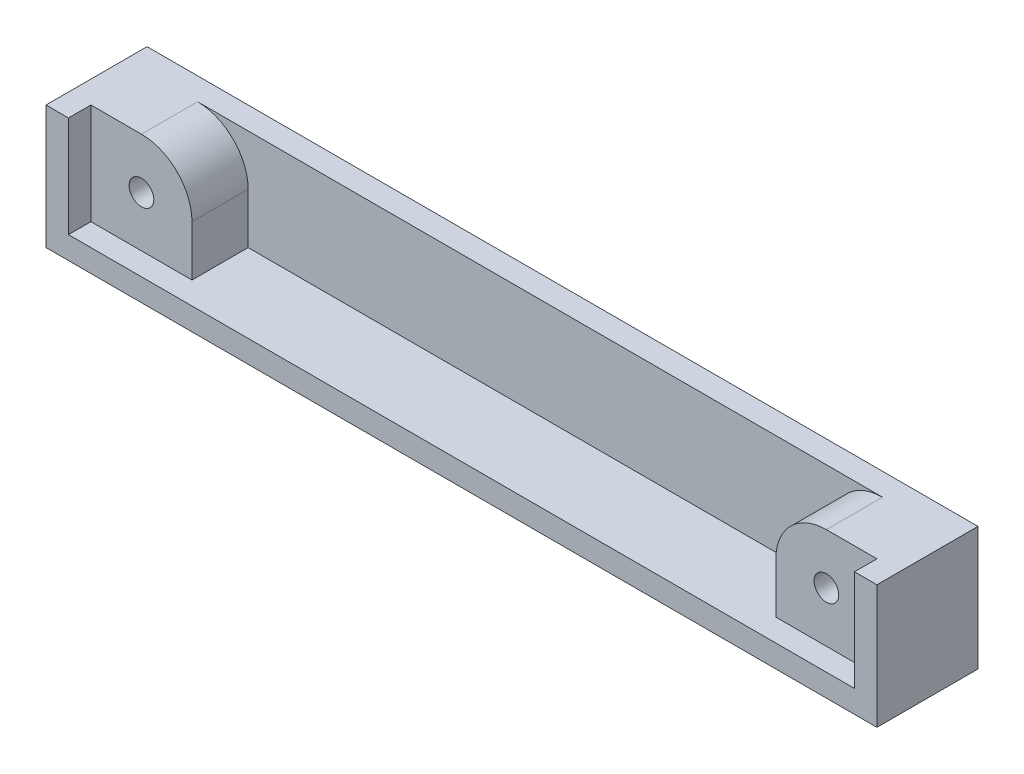
ISO-10303-21;
HEADER;
FILE_DESCRIPTION(('STEP AP214'),'2;1');
FILE_NAME('part.step','',(''),(''),'','','');
FILE_SCHEMA(('AUTOMOTIVE_DESIGN { 1 0 10303 214 1 1 1 1 }'));
ENDSEC;
DATA;
#1=APPLICATION_CONTEXT('core data for automotive mechanical design processes');
#2=APPLICATION_PROTOCOL_DEFINITION('international standard','automotive_design',2000,#1);
#3=PRODUCT_CONTEXT('',#1,'mechanical');
#4=PRODUCT('Part','Part','',(#3));
#5=PRODUCT_RELATED_PRODUCT_CATEGORY('part','',(#4));
#6=PRODUCT_DEFINITION_FORMATION('','',#4);
#7=PRODUCT_DEFINITION_CONTEXT('part definition',#1,'design');
#8=PRODUCT_DEFINITION('design','',#6,#7);
#9=PRODUCT_DEFINITION_SHAPE('','',#8);
#10=(LENGTH_UNIT() NAMED_UNIT(*) SI_UNIT(.MILLI.,.METRE.));
#11=(NAMED_UNIT(*) PLANE_ANGLE_UNIT() SI_UNIT($,.RADIAN.));
#12=(NAMED_UNIT(*) SI_UNIT($,.STERADIAN.) SOLID_ANGLE_UNIT());
#13=UNCERTAINTY_MEASURE_WITH_UNIT(LENGTH_MEASURE(1.E-05),#10,'distance_accuracy_value','');
#14=(GEOMETRIC_REPRESENTATION_CONTEXT(3) GLOBAL_UNCERTAINTY_ASSIGNED_CONTEXT((#13)) GLOBAL_UNIT_ASSIGNED_CONTEXT((#10,
#11,#12)) REPRESENTATION_CONTEXT('',''));
#15=CARTESIAN_POINT('',(0.,0.,0.));
#16=DIRECTION('',(0.,0.,1.));
#17=DIRECTION('',(1.,0.,0.));
#18=AXIS2_PLACEMENT_3D('',#15,#16,#17);
#19=CARTESIAN_POINT('',(11.,0.,7.));
#20=DIRECTION('',(1.,0.,0.));
#21=DIRECTION('',(0.,0.,-1.));
#22=AXIS2_PLACEMENT_3D('',#19,#20,#21);
#23=PLANE('',#22);
#24=DIRECTION('',(0.,-1.,0.));
#25=VECTOR('',#24,1.);
#26=CARTESIAN_POINT('',(11.,0.,2.));
#27=LINE('',#26,#25);
#28=CARTESIAN_POINT('',(11.,6.5,2.));
#29=VERTEX_POINT('',#28);
#30=CARTESIAN_POINT('',(11.,2.,2.));
#31=VERTEX_POINT('',#30);
#32=EDGE_CURVE('E220',#29,#31,#27,.T.);
#33=ORIENTED_EDGE('',*,*,#32,.F.);
#34=DIRECTION('',(0.,0.,-1.));
#35=VECTOR('',#34,1.);
#36=CARTESIAN_POINT('',(11.,6.5,7.));
#37=LINE('',#36,#35);
#38=CARTESIAN_POINT('',(11.,6.5,7.));
#39=VERTEX_POINT('',#38);
#40=EDGE_CURVE('E50',#29,#39,#37,.F.);
#41=ORIENTED_EDGE('',*,*,#40,.T.);
#42=DIRECTION('',(0.,-1.,0.));
#43=VECTOR('',#42,1.);
#44=CARTESIAN_POINT('',(11.,0.,7.));
#45=LINE('',#44,#43);
#46=CARTESIAN_POINT('',(11.,2.,7.));
#47=VERTEX_POINT('',#46);
#48=EDGE_CURVE('E231',#39,#47,#45,.T.);
#49=ORIENTED_EDGE('',*,*,#48,.T.);
#50=DIRECTION('',(0.,0.,-1.));
#51=VECTOR('',#50,1.);
#52=CARTESIAN_POINT('',(11.,2.,7.));
#53=LINE('',#52,#51);
#54=EDGE_CURVE('E243',#47,#31,#53,.T.);
#55=ORIENTED_EDGE('',*,*,#54,.T.);
#56=EDGE_LOOP('',(#33,#41,#49,#55));
#57=FACE_BOUND('',#56,.T.);
#58=ADVANCED_FACE('F35',(#57),#23,.T.);
#59=CARTESIAN_POINT('',(0.,11.,7.));
#60=DIRECTION('',(0.,1.,0.));
#61=DIRECTION('',(0.,0.,1.));
#62=AXIS2_PLACEMENT_3D('',#59,#60,#61);
#63=PLANE('',#62);
#64=DIRECTION('',(1.,0.,0.));
#65=VECTOR('',#64,1.);
#66=CARTESIAN_POINT('',(0.,11.,2.));
#67=LINE('',#66,#65);
#68=CARTESIAN_POINT('',(6.5,11.,2.));
#69=VERTEX_POINT('',#68);
#70=CARTESIAN_POINT('',(67.5,11.,2.));
#71=VERTEX_POINT('',#70);
#72=EDGE_CURVE('E218',#69,#71,#67,.T.);
#73=ORIENTED_EDGE('',*,*,#72,.T.);
#74=DIRECTION('',(0.,0.,-1.));
#75=VECTOR('',#74,1.);
#76=CARTESIAN_POINT('',(67.5,11.,7.));
#77=LINE('',#76,#75);
#78=CARTESIAN_POINT('',(67.5,11.,7.));
#79=VERTEX_POINT('',#78);
#80=EDGE_CURVE('E255',#71,#79,#77,.F.);
#81=ORIENTED_EDGE('',*,*,#80,.T.);
#82=DIRECTION('',(1.,0.,0.));
#83=VECTOR('',#82,1.);
#84=CARTESIAN_POINT('',(0.,11.,7.));
#85=LINE('',#84,#83);
#86=CARTESIAN_POINT('',(72.,11.,7.));
#87=VERTEX_POINT('',#86);
#88=EDGE_CURVE('E141',#79,#87,#85,.T.);
#89=ORIENTED_EDGE('',*,*,#88,.T.);
#90=DIRECTION('',(0.,0.,-1.));
#91=VECTOR('',#90,1.);
#92=CARTESIAN_POINT('',(72.,11.,9.));
#93=LINE('',#92,#91);
#94=CARTESIAN_POINT('',(72.,11.,9.));
#95=VERTEX_POINT('',#94);
#96=EDGE_CURVE('E134',#95,#87,#93,.T.);
#97=ORIENTED_EDGE('',*,*,#96,.F.);
#98=DIRECTION('',(1.,0.,0.));
#99=VECTOR('',#98,1.);
#100=CARTESIAN_POINT('',(0.,11.,9.));
#101=LINE('',#100,#99);
#102=CARTESIAN_POINT('',(74.,11.,9.));
#103=VERTEX_POINT('',#102);
#104=EDGE_CURVE('E139',#95,#103,#101,.T.);
#105=ORIENTED_EDGE('',*,*,#104,.T.);
#106=DIRECTION('',(0.,0.,-1.));
#107=VECTOR('',#106,1.);
#108=CARTESIAN_POINT('',(74.,11.,9.));
#109=LINE('',#108,#107);
#110=CARTESIAN_POINT('',(74.,11.,0.));
#111=VERTEX_POINT('',#110);
#112=EDGE_CURVE('E183',#103,#111,#109,.T.);
#113=ORIENTED_EDGE('',*,*,#112,.T.);
#114=DIRECTION('',(1.,0.,0.));
#115=VECTOR('',#114,1.);
#116=CARTESIAN_POINT('',(0.,11.,0.));
#117=LINE('',#116,#115);
#118=CARTESIAN_POINT('',(0.,11.,0.));
#119=VERTEX_POINT('',#118);
#120=EDGE_CURVE('E232',#119,#111,#117,.T.);
#121=ORIENTED_EDGE('',*,*,#120,.F.);
#122=DIRECTION('',(0.,0.,-1.));
#123=VECTOR('',#122,1.);
#124=CARTESIAN_POINT('',(0.,11.,9.));
#125=LINE('',#124,#123);
#126=CARTESIAN_POINT('',(0.,11.,9.));
#127=VERTEX_POINT('',#126);
#128=EDGE_CURVE('E194',#127,#119,#125,.T.);
#129=ORIENTED_EDGE('',*,*,#128,.F.);
#130=CARTESIAN_POINT('',(2.,11.,9.));
#131=VERTEX_POINT('',#130);
#132=EDGE_CURVE('E162',#127,#131,#101,.T.);
#133=ORIENTED_EDGE('',*,*,#132,.T.);
#134=DIRECTION('',(0.,0.,-1.));
#135=VECTOR('',#134,1.);
#136=CARTESIAN_POINT('',(2.,11.,9.));
#137=LINE('',#136,#135);
#138=CARTESIAN_POINT('',(2.,11.,7.));
#139=VERTEX_POINT('',#138);
#140=EDGE_CURVE('E197',#131,#139,#137,.T.);
#141=ORIENTED_EDGE('',*,*,#140,.T.);
#142=DIRECTION('',(1.,0.,0.));
#143=VECTOR('',#142,1.);
#144=CARTESIAN_POINT('',(0.,11.,7.));
#145=LINE('',#144,#143);
#146=CARTESIAN_POINT('',(6.5,11.,7.));
#147=VERTEX_POINT('',#146);
#148=EDGE_CURVE('E234',#139,#147,#145,.T.);
#149=ORIENTED_EDGE('',*,*,#148,.T.);
#150=DIRECTION('',(0.,0.,-1.));
#151=VECTOR('',#150,1.);
#152=CARTESIAN_POINT('',(6.5,11.,7.));
#153=LINE('',#152,#151);
#154=EDGE_CURVE('E252',#147,#69,#153,.T.);
#155=ORIENTED_EDGE('',*,*,#154,.T.);
#156=EDGE_LOOP('',(#73,#81,#89,#97,#105,#113,#121,#129,#133,#141,#149,#155));
#157=FACE_BOUND('',#156,.T.);
#158=ADVANCED_FACE('F136',(#157),#63,.T.);
#159=CARTESIAN_POINT('',(6.5,6.5,7.));
#160=DIRECTION('',(0.,0.,-1.));
#161=DIRECTION('',(-1.,0.,0.));
#162=AXIS2_PLACEMENT_3D('',#159,#160,#161);
#163=CYLINDRICAL_SURFACE('',#162,1.1);
#164=CARTESIAN_POINT('',(6.5,6.5,7.));
#165=DIRECTION('',(0.,0.,1.));
#166=DIRECTION('',(1.,0.,0.));
#167=AXIS2_PLACEMENT_3D('',#164,#165,#166);
#168=CIRCLE('',#167,1.1);
#169=CARTESIAN_POINT('',(7.6,6.5,7.));
#170=VERTEX_POINT('',#169);
#171=EDGE_CURVE('E228',#170,#170,#168,.T.);
#172=ORIENTED_EDGE('',*,*,#171,.T.);
#173=EDGE_LOOP('',(#172));
#174=FACE_BOUND('',#173,.T.);
#175=CARTESIAN_POINT('',(6.5,6.5,0.));
#176=DIRECTION('',(0.,0.,1.));
#177=DIRECTION('',(1.,0.,0.));
#178=AXIS2_PLACEMENT_3D('',#175,#176,#177);
#179=CIRCLE('',#178,1.1);
#180=CARTESIAN_POINT('',(7.6,6.5,0.));
#181=VERTEX_POINT('',#180);
#182=EDGE_CURVE('E227',#181,#181,#179,.T.);
#183=ORIENTED_EDGE('',*,*,#182,.F.);
#184=EDGE_LOOP('',(#183));
#185=FACE_BOUND('',#184,.T.);
#186=ADVANCED_FACE('F297',(#174,#185),#163,.F.);
#187=CARTESIAN_POINT('',(0.,0.,7.));
#188=DIRECTION('',(0.,0.,1.));
#189=DIRECTION('',(1.,0.,0.));
#190=AXIS2_PLACEMENT_3D('',#187,#188,#189);
#191=PLANE('',#190);
#192=ORIENTED_EDGE('',*,*,#171,.F.);
#193=EDGE_LOOP('',(#192));
#194=FACE_BOUND('',#193,.T.);
#195=ORIENTED_EDGE('',*,*,#48,.F.);
#196=CARTESIAN_POINT('',(6.5,6.5,7.));
#197=DIRECTION('',(0.,0.,1.));
#198=DIRECTION('',(1.,0.,0.));
#199=AXIS2_PLACEMENT_3D('',#196,#197,#198);
#200=CIRCLE('',#199,4.5);
#201=EDGE_CURVE('E260',#39,#147,#200,.T.);
#202=ORIENTED_EDGE('',*,*,#201,.T.);
#203=ORIENTED_EDGE('',*,*,#148,.F.);
#204=DIRECTION('',(0.,-1.,0.));
#205=VECTOR('',#204,1.);
#206=CARTESIAN_POINT('',(2.,0.,7.));
#207=LINE('',#206,#205);
#208=CARTESIAN_POINT('',(2.,2.,7.));
#209=VERTEX_POINT('',#208);
#210=EDGE_CURVE('E237',#139,#209,#207,.T.);
#211=ORIENTED_EDGE('',*,*,#210,.T.);
#212=DIRECTION('',(1.,0.,0.));
#213=VECTOR('',#212,1.);
#214=CARTESIAN_POINT('',(0.,2.,7.));
#215=LINE('',#214,#213);
#216=EDGE_CURVE('E240',#209,#47,#215,.T.);
#217=ORIENTED_EDGE('',*,*,#216,.T.);
#218=EDGE_LOOP('',(#195,#202,#203,#211,#217));
#219=FACE_BOUND('',#218,.T.);
#220=ADVANCED_FACE('F302',(#194,#219),#191,.T.);
#221=CARTESIAN_POINT('',(0.,0.,0.));
#222=DIRECTION('',(0.,0.,1.));
#223=DIRECTION('',(1.,0.,0.));
#224=AXIS2_PLACEMENT_3D('',#221,#222,#223);
#225=PLANE('',#224);
#226=ORIENTED_EDGE('',*,*,#182,.T.);
#227=EDGE_LOOP('',(#226));
#228=FACE_BOUND('',#227,.T.);
#229=ORIENTED_EDGE('',*,*,#120,.T.);
#230=DIRECTION('',(0.,1.,0.));
#231=VECTOR('',#230,1.);
#232=CARTESIAN_POINT('',(74.,0.,0.));
#233=LINE('',#232,#231);
#234=CARTESIAN_POINT('',(74.,0.,0.));
#235=VERTEX_POINT('',#234);
#236=EDGE_CURVE('E160',#235,#111,#233,.T.);
#237=ORIENTED_EDGE('',*,*,#236,.F.);
#238=DIRECTION('',(1.,0.,0.));
#239=VECTOR('',#238,1.);
#240=CARTESIAN_POINT('',(0.,0.,0.));
#241=LINE('',#240,#239);
#242=CARTESIAN_POINT('',(0.,0.,0.));
#243=VERTEX_POINT('',#242);
#244=EDGE_CURVE('E164',#243,#235,#241,.T.);
#245=ORIENTED_EDGE('',*,*,#244,.F.);
#246=DIRECTION('',(0.,1.,0.));
#247=VECTOR('',#246,1.);
#248=CARTESIAN_POINT('',(0.,0.,0.));
#249=LINE('',#248,#247);
#250=EDGE_CURVE('E184',#243,#119,#249,.T.);
#251=ORIENTED_EDGE('',*,*,#250,.T.);
#252=EDGE_LOOP('',(#229,#237,#245,#251));
#253=FACE_BOUND('',#252,.T.);
#254=CARTESIAN_POINT('',(67.5,6.5,0.));
#255=DIRECTION('',(0.,0.,1.));
#256=DIRECTION('',(1.,0.,0.));
#257=AXIS2_PLACEMENT_3D('',#254,#255,#256);
#258=CIRCLE('',#257,1.10000000000001);
#259=CARTESIAN_POINT('',(68.6,6.5,0.));
#260=VERTEX_POINT('',#259);
#261=EDGE_CURVE('E145',#260,#260,#258,.T.);
#262=ORIENTED_EDGE('',*,*,#261,.T.);
#263=EDGE_LOOP('',(#262));
#264=FACE_BOUND('',#263,.T.);
#265=ADVANCED_FACE('F289',(#228,#253,#264),#225,.F.);
#266=CARTESIAN_POINT('',(0.,0.,2.));
#267=DIRECTION('',(0.,0.,1.));
#268=DIRECTION('',(1.,0.,0.));
#269=AXIS2_PLACEMENT_3D('',#266,#267,#268);
#270=PLANE('',#269);
#271=ORIENTED_EDGE('',*,*,#72,.F.);
#272=CARTESIAN_POINT('',(6.5,6.5,2.));
#273=DIRECTION('',(0.,0.,1.));
#274=DIRECTION('',(1.,0.,0.));
#275=AXIS2_PLACEMENT_3D('',#272,#273,#274);
#276=CIRCLE('',#275,4.5);
#277=EDGE_CURVE('E11',#69,#29,#276,.F.);
#278=ORIENTED_EDGE('',*,*,#277,.T.);
#279=ORIENTED_EDGE('',*,*,#32,.T.);
#280=DIRECTION('',(1.,0.,0.));
#281=VECTOR('',#280,1.);
#282=CARTESIAN_POINT('',(0.,2.,2.));
#283=LINE('',#282,#281);
#284=CARTESIAN_POINT('',(63.,2.,2.));
#285=VERTEX_POINT('',#284);
#286=EDGE_CURVE('E222',#31,#285,#283,.T.);
#287=ORIENTED_EDGE('',*,*,#286,.T.);
#288=DIRECTION('',(0.,-1.,0.));
#289=VECTOR('',#288,1.);
#290=CARTESIAN_POINT('',(63.,0.,2.));
#291=LINE('',#290,#289);
#292=CARTESIAN_POINT('',(63.,6.5,2.));
#293=VERTEX_POINT('',#292);
#294=EDGE_CURVE('E225',#293,#285,#291,.T.);
#295=ORIENTED_EDGE('',*,*,#294,.F.);
#296=CARTESIAN_POINT('',(67.5,6.5,2.));
#297=DIRECTION('',(0.,0.,1.));
#298=DIRECTION('',(1.,0.,0.));
#299=AXIS2_PLACEMENT_3D('',#296,#297,#298);
#300=CIRCLE('',#299,4.5);
#301=EDGE_CURVE('E43',#293,#71,#300,.F.);
#302=ORIENTED_EDGE('',*,*,#301,.T.);
#303=EDGE_LOOP('',(#271,#278,#279,#287,#295,#302));
#304=FACE_BOUND('',#303,.T.);
#305=ADVANCED_FACE('F264',(#304),#270,.T.);
#306=CARTESIAN_POINT('',(63.,0.,7.));
#307=DIRECTION('',(1.,0.,0.));
#308=DIRECTION('',(0.,0.,-1.));
#309=AXIS2_PLACEMENT_3D('',#306,#307,#308);
#310=PLANE('',#309);
#311=DIRECTION('',(0.,-1.,0.));
#312=VECTOR('',#311,1.);
#313=CARTESIAN_POINT('',(63.,0.,7.));
#314=LINE('',#313,#312);
#315=CARTESIAN_POINT('',(63.,6.5,7.));
#316=VERTEX_POINT('',#315);
#317=CARTESIAN_POINT('',(63.,2.,7.));
#318=VERTEX_POINT('',#317);
#319=EDGE_CURVE('E206',#316,#318,#314,.T.);
#320=ORIENTED_EDGE('',*,*,#319,.F.);
#321=DIRECTION('',(0.,0.,-1.));
#322=VECTOR('',#321,1.);
#323=CARTESIAN_POINT('',(63.,6.5,2.));
#324=LINE('',#323,#322);
#325=EDGE_CURVE('E249',#316,#293,#324,.T.);
#326=ORIENTED_EDGE('',*,*,#325,.T.);
#327=ORIENTED_EDGE('',*,*,#294,.T.);
#328=DIRECTION('',(0.,0.,-1.));
#329=VECTOR('',#328,1.);
#330=CARTESIAN_POINT('',(63.,2.,7.));
#331=LINE('',#330,#329);
#332=EDGE_CURVE('E213',#318,#285,#331,.T.);
#333=ORIENTED_EDGE('',*,*,#332,.F.);
#334=EDGE_LOOP('',(#320,#326,#327,#333));
#335=FACE_BOUND('',#334,.T.);
#336=ADVANCED_FACE('F279',(#335),#310,.F.);
#337=CARTESIAN_POINT('',(67.5,6.5,7.));
#338=DIRECTION('',(0.,0.,-1.));
#339=DIRECTION('',(-1.,0.,0.));
#340=AXIS2_PLACEMENT_3D('',#337,#338,#339);
#341=CYLINDRICAL_SURFACE('',#340,1.10000000000001);
#342=CARTESIAN_POINT('',(67.5,6.5,7.));
#343=DIRECTION('',(0.,0.,1.));
#344=DIRECTION('',(1.,0.,0.));
#345=AXIS2_PLACEMENT_3D('',#342,#343,#344);
#346=CIRCLE('',#345,1.10000000000001);
#347=CARTESIAN_POINT('',(68.6,6.5,7.));
#348=VERTEX_POINT('',#347);
#349=EDGE_CURVE('E202',#348,#348,#346,.T.);
#350=ORIENTED_EDGE('',*,*,#349,.T.);
#351=EDGE_LOOP('',(#350));
#352=FACE_BOUND('',#351,.T.);
#353=ORIENTED_EDGE('',*,*,#261,.F.);
#354=EDGE_LOOP('',(#353));
#355=FACE_BOUND('',#354,.T.);
#356=ADVANCED_FACE('F281',(#352,#355),#341,.F.);
#357=CARTESIAN_POINT('',(0.,0.,7.));
#358=DIRECTION('',(0.,0.,1.));
#359=DIRECTION('',(1.,0.,0.));
#360=AXIS2_PLACEMENT_3D('',#357,#358,#359);
#361=PLANE('',#360);
#362=ORIENTED_EDGE('',*,*,#349,.F.);
#363=EDGE_LOOP('',(#362));
#364=FACE_BOUND('',#363,.T.);
#365=ORIENTED_EDGE('',*,*,#88,.F.);
#366=CARTESIAN_POINT('',(67.5,6.5,7.));
#367=DIRECTION('',(0.,0.,1.));
#368=DIRECTION('',(1.,0.,0.));
#369=AXIS2_PLACEMENT_3D('',#366,#367,#368);
#370=CIRCLE('',#369,4.5);
#371=EDGE_CURVE('E257',#79,#316,#370,.T.);
#372=ORIENTED_EDGE('',*,*,#371,.T.);
#373=ORIENTED_EDGE('',*,*,#319,.T.);
#374=DIRECTION('',(1.,0.,0.));
#375=VECTOR('',#374,1.);
#376=CARTESIAN_POINT('',(0.,2.,7.));
#377=LINE('',#376,#375);
#378=CARTESIAN_POINT('',(72.,2.,7.));
#379=VERTEX_POINT('',#378);
#380=EDGE_CURVE('E208',#318,#379,#377,.T.);
#381=ORIENTED_EDGE('',*,*,#380,.T.);
#382=DIRECTION('',(0.,-1.,0.));
#383=VECTOR('',#382,1.);
#384=CARTESIAN_POINT('',(72.,0.,7.));
#385=LINE('',#384,#383);
#386=EDGE_CURVE('E211',#87,#379,#385,.T.);
#387=ORIENTED_EDGE('',*,*,#386,.F.);
#388=EDGE_LOOP('',(#365,#372,#373,#381,#387));
#389=FACE_BOUND('',#388,.T.);
#390=ADVANCED_FACE('F270',(#364,#389),#361,.T.);
#391=CARTESIAN_POINT('',(72.,0.,9.));
#392=DIRECTION('',(1.,0.,0.));
#393=DIRECTION('',(0.,0.,-1.));
#394=AXIS2_PLACEMENT_3D('',#391,#392,#393);
#395=PLANE('',#394);
#396=ORIENTED_EDGE('',*,*,#386,.T.);
#397=DIRECTION('',(0.,0.,-1.));
#398=VECTOR('',#397,1.);
#399=CARTESIAN_POINT('',(72.,2.,9.));
#400=LINE('',#399,#398);
#401=CARTESIAN_POINT('',(72.,2.,9.));
#402=VERTEX_POINT('',#401);
#403=EDGE_CURVE('E146',#402,#379,#400,.T.);
#404=ORIENTED_EDGE('',*,*,#403,.F.);
#405=DIRECTION('',(0.,-1.,0.));
#406=VECTOR('',#405,1.);
#407=CARTESIAN_POINT('',(72.,0.,9.));
#408=LINE('',#407,#406);
#409=EDGE_CURVE('E149',#95,#402,#408,.T.);
#410=ORIENTED_EDGE('',*,*,#409,.F.);
#411=ORIENTED_EDGE('',*,*,#96,.T.);
#412=EDGE_LOOP('',(#396,#404,#410,#411));
#413=FACE_BOUND('',#412,.T.);
#414=ADVANCED_FACE('F150',(#413),#395,.F.);
#415=CARTESIAN_POINT('',(0.,2.,9.));
#416=DIRECTION('',(0.,1.,0.));
#417=DIRECTION('',(0.,0.,1.));
#418=AXIS2_PLACEMENT_3D('',#415,#416,#417);
#419=PLANE('',#418);
#420=ORIENTED_EDGE('',*,*,#54,.F.);
#421=ORIENTED_EDGE('',*,*,#216,.F.);
#422=DIRECTION('',(0.,0.,-1.));
#423=VECTOR('',#422,1.);
#424=CARTESIAN_POINT('',(2.,2.,9.));
#425=LINE('',#424,#423);
#426=CARTESIAN_POINT('',(2.,2.,9.));
#427=VERTEX_POINT('',#426);
#428=EDGE_CURVE('E199',#427,#209,#425,.T.);
#429=ORIENTED_EDGE('',*,*,#428,.F.);
#430=DIRECTION('',(1.,0.,0.));
#431=VECTOR('',#430,1.);
#432=CARTESIAN_POINT('',(0.,2.,9.));
#433=LINE('',#432,#431);
#434=EDGE_CURVE('E154',#427,#402,#433,.T.);
#435=ORIENTED_EDGE('',*,*,#434,.T.);
#436=ORIENTED_EDGE('',*,*,#403,.T.);
#437=ORIENTED_EDGE('',*,*,#380,.F.);
#438=ORIENTED_EDGE('',*,*,#332,.T.);
#439=ORIENTED_EDGE('',*,*,#286,.F.);
#440=EDGE_LOOP('',(#420,#421,#429,#435,#436,#437,#438,#439));
#441=FACE_BOUND('',#440,.T.);
#442=ADVANCED_FACE('F276',(#441),#419,.T.);
#443=CARTESIAN_POINT('',(2.,0.,9.));
#444=DIRECTION('',(1.,0.,0.));
#445=DIRECTION('',(0.,1.,0.));
#446=AXIS2_PLACEMENT_3D('',#443,#444,#445);
#447=PLANE('',#446);
#448=ORIENTED_EDGE('',*,*,#428,.T.);
#449=ORIENTED_EDGE('',*,*,#210,.F.);
#450=ORIENTED_EDGE('',*,*,#140,.F.);
#451=DIRECTION('',(0.,-1.,0.));
#452=VECTOR('',#451,1.);
#453=CARTESIAN_POINT('',(2.,0.,9.));
#454=LINE('',#453,#452);
#455=EDGE_CURVE('E168',#131,#427,#454,.T.);
#456=ORIENTED_EDGE('',*,*,#455,.T.);
#457=EDGE_LOOP('',(#448,#449,#450,#456));
#458=FACE_BOUND('',#457,.T.);
#459=ADVANCED_FACE('F325',(#458),#447,.T.);
#460=CARTESIAN_POINT('',(0.,0.,9.));
#461=DIRECTION('',(-1.,0.,0.));
#462=DIRECTION('',(0.,0.,1.));
#463=AXIS2_PLACEMENT_3D('',#460,#461,#462);
#464=PLANE('',#463);
#465=ORIENTED_EDGE('',*,*,#250,.F.);
#466=DIRECTION('',(0.,0.,-1.));
#467=VECTOR('',#466,1.);
#468=CARTESIAN_POINT('',(0.,0.,9.));
#469=LINE('',#468,#467);
#470=CARTESIAN_POINT('',(0.,0.,9.));
#471=VERTEX_POINT('',#470);
#472=EDGE_CURVE('E192',#471,#243,#469,.T.);
#473=ORIENTED_EDGE('',*,*,#472,.F.);
#474=DIRECTION('',(0.,1.,0.));
#475=VECTOR('',#474,1.);
#476=CARTESIAN_POINT('',(0.,0.,9.));
#477=LINE('',#476,#475);
#478=EDGE_CURVE('E167',#471,#127,#477,.T.);
#479=ORIENTED_EDGE('',*,*,#478,.T.);
#480=ORIENTED_EDGE('',*,*,#128,.T.);
#481=EDGE_LOOP('',(#465,#473,#479,#480));
#482=FACE_BOUND('',#481,.T.);
#483=ADVANCED_FACE('F321',(#482),#464,.T.);
#484=CARTESIAN_POINT('',(0.,0.,9.));
#485=DIRECTION('',(0.,1.,0.));
#486=DIRECTION('',(0.,0.,1.));
#487=AXIS2_PLACEMENT_3D('',#484,#485,#486);
#488=PLANE('',#487);
#489=ORIENTED_EDGE('',*,*,#244,.T.);
#490=DIRECTION('',(0.,0.,-1.));
#491=VECTOR('',#490,1.);
#492=CARTESIAN_POINT('',(74.,0.,9.));
#493=LINE('',#492,#491);
#494=CARTESIAN_POINT('',(74.,0.,9.));
#495=VERTEX_POINT('',#494);
#496=EDGE_CURVE('E189',#495,#235,#493,.T.);
#497=ORIENTED_EDGE('',*,*,#496,.F.);
#498=DIRECTION('',(1.,0.,0.));
#499=VECTOR('',#498,1.);
#500=CARTESIAN_POINT('',(0.,0.,9.));
#501=LINE('',#500,#499);
#502=EDGE_CURVE('E172',#471,#495,#501,.T.);
#503=ORIENTED_EDGE('',*,*,#502,.F.);
#504=ORIENTED_EDGE('',*,*,#472,.T.);
#505=EDGE_LOOP('',(#489,#497,#503,#504));
#506=FACE_BOUND('',#505,.T.);
#507=ADVANCED_FACE('F315',(#506),#488,.F.);
#508=CARTESIAN_POINT('',(74.,0.,9.));
#509=DIRECTION('',(-1.,0.,0.));
#510=DIRECTION('',(0.,0.,1.));
#511=AXIS2_PLACEMENT_3D('',#508,#509,#510);
#512=PLANE('',#511);
#513=ORIENTED_EDGE('',*,*,#236,.T.);
#514=ORIENTED_EDGE('',*,*,#112,.F.);
#515=DIRECTION('',(0.,1.,0.));
#516=VECTOR('',#515,1.);
#517=CARTESIAN_POINT('',(74.,0.,9.));
#518=LINE('',#517,#516);
#519=EDGE_CURVE('E158',#495,#103,#518,.T.);
#520=ORIENTED_EDGE('',*,*,#519,.F.);
#521=ORIENTED_EDGE('',*,*,#496,.T.);
#522=EDGE_LOOP('',(#513,#514,#520,#521));
#523=FACE_BOUND('',#522,.T.);
#524=ADVANCED_FACE('F310',(#523),#512,.F.);
#525=CARTESIAN_POINT('',(0.,0.,9.));
#526=DIRECTION('',(0.,0.,1.));
#527=DIRECTION('',(1.,0.,0.));
#528=AXIS2_PLACEMENT_3D('',#525,#526,#527);
#529=PLANE('',#528);
#530=ORIENTED_EDGE('',*,*,#104,.F.);
#531=ORIENTED_EDGE('',*,*,#409,.T.);
#532=ORIENTED_EDGE('',*,*,#434,.F.);
#533=ORIENTED_EDGE('',*,*,#455,.F.);
#534=ORIENTED_EDGE('',*,*,#132,.F.);
#535=ORIENTED_EDGE('',*,*,#478,.F.);
#536=ORIENTED_EDGE('',*,*,#502,.T.);
#537=ORIENTED_EDGE('',*,*,#519,.T.);
#538=EDGE_LOOP('',(#530,#531,#532,#533,#534,#535,#536,#537));
#539=FACE_BOUND('',#538,.T.);
#540=ADVANCED_FACE('F156',(#539),#529,.T.);
#541=CARTESIAN_POINT('',(67.5,6.5,7.));
#542=DIRECTION('',(0.,0.,1.));
#543=DIRECTION('',(1.,0.,0.));
#544=AXIS2_PLACEMENT_3D('',#541,#542,#543);
#545=CYLINDRICAL_SURFACE('',#544,4.5);
#546=ORIENTED_EDGE('',*,*,#371,.F.);
#547=ORIENTED_EDGE('',*,*,#80,.F.);
#548=ORIENTED_EDGE('',*,*,#301,.F.);
#549=ORIENTED_EDGE('',*,*,#325,.F.);
#550=EDGE_LOOP('',(#546,#547,#548,#549));
#551=FACE_BOUND('',#550,.T.);
#552=ADVANCED_FACE('F268',(#551),#545,.T.);
#553=CARTESIAN_POINT('',(6.5,6.5,7.));
#554=DIRECTION('',(0.,0.,-1.));
#555=DIRECTION('',(-1.,0.,0.));
#556=AXIS2_PLACEMENT_3D('',#553,#554,#555);
#557=CYLINDRICAL_SURFACE('',#556,4.5);
#558=ORIENTED_EDGE('',*,*,#201,.F.);
#559=ORIENTED_EDGE('',*,*,#40,.F.);
#560=ORIENTED_EDGE('',*,*,#277,.F.);
#561=ORIENTED_EDGE('',*,*,#154,.F.);
#562=EDGE_LOOP('',(#558,#559,#560,#561));
#563=FACE_BOUND('',#562,.T.);
#564=ADVANCED_FACE('F37',(#563),#557,.T.);
#565=CLOSED_SHELL('',(#58,#158,#186,#220,#265,#305,#336,#356,#390,#414,#442,#459,#483,#507,#524,
#540,#552,#564));
#566=MANIFOLD_SOLID_BREP('B2',#565);
#567=ADVANCED_BREP_SHAPE_REPRESENTATION('',(#18,#566),#14);
#568=SHAPE_DEFINITION_REPRESENTATION(#9,#567);
ENDSEC;
END-ISO-10303-21;
